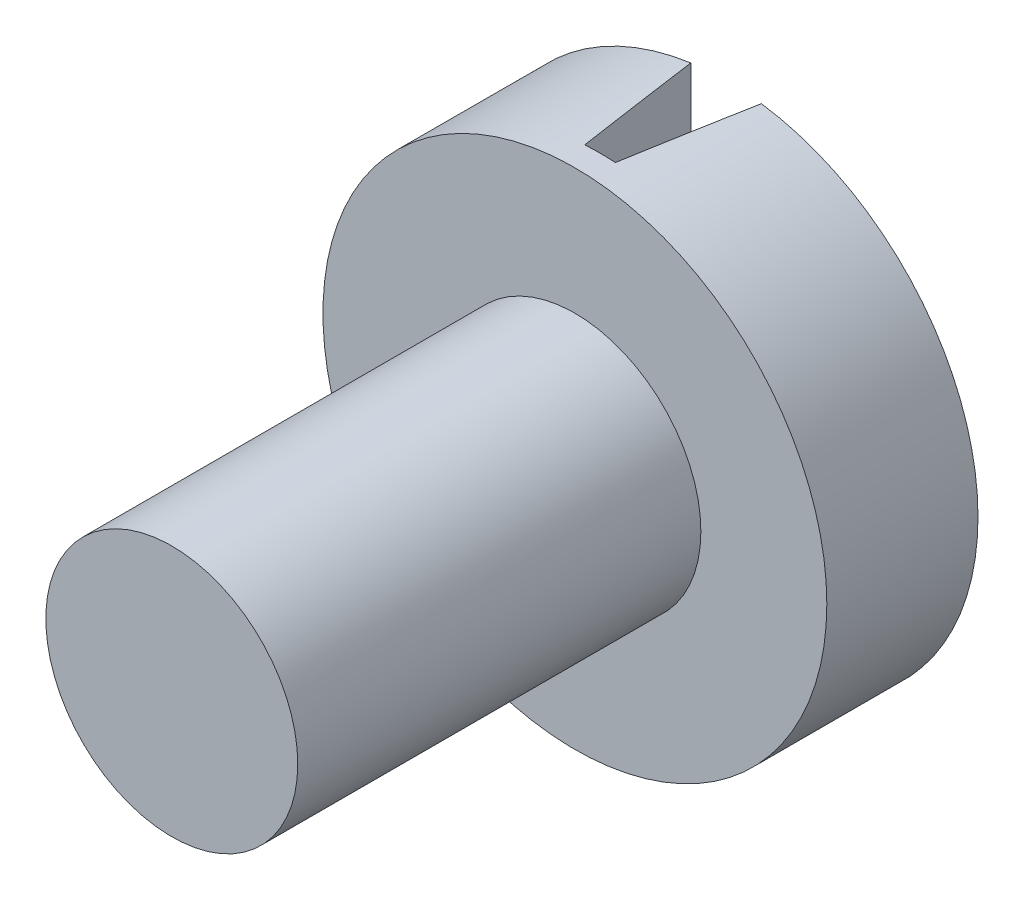
ISO-10303-21;
HEADER;
FILE_DESCRIPTION(('STEP AP214'),'2;1');
FILE_NAME('part.step','',(''),(''),'','','');
FILE_SCHEMA(('AUTOMOTIVE_DESIGN { 1 0 10303 214 1 1 1 1 }'));
ENDSEC;
DATA;
#1=APPLICATION_CONTEXT('core data for automotive mechanical design processes');
#2=APPLICATION_PROTOCOL_DEFINITION('international standard','automotive_design',2000,#1);
#3=PRODUCT_CONTEXT('',#1,'mechanical');
#4=PRODUCT('Part','Part','',(#3));
#5=PRODUCT_RELATED_PRODUCT_CATEGORY('part','',(#4));
#6=PRODUCT_DEFINITION_FORMATION('','',#4);
#7=PRODUCT_DEFINITION_CONTEXT('part definition',#1,'design');
#8=PRODUCT_DEFINITION('design','',#6,#7);
#9=PRODUCT_DEFINITION_SHAPE('','',#8);
#10=(LENGTH_UNIT() NAMED_UNIT(*) SI_UNIT(.MILLI.,.METRE.));
#11=(NAMED_UNIT(*) PLANE_ANGLE_UNIT() SI_UNIT($,.RADIAN.));
#12=(NAMED_UNIT(*) SI_UNIT($,.STERADIAN.) SOLID_ANGLE_UNIT());
#13=UNCERTAINTY_MEASURE_WITH_UNIT(LENGTH_MEASURE(1.E-05),#10,'distance_accuracy_value','');
#14=(GEOMETRIC_REPRESENTATION_CONTEXT(3) GLOBAL_UNCERTAINTY_ASSIGNED_CONTEXT((#13)) GLOBAL_UNIT_ASSIGNED_CONTEXT((#10,
#11,#12)) REPRESENTATION_CONTEXT('',''));
#15=CARTESIAN_POINT('',(0.,0.,0.));
#16=DIRECTION('',(0.,0.,1.));
#17=DIRECTION('',(1.,0.,0.));
#18=AXIS2_PLACEMENT_3D('',#15,#16,#17);
#19=CARTESIAN_POINT('',(0.,0.,-3.));
#20=DIRECTION('',(0.,0.,1.));
#21=DIRECTION('',(1.,0.,0.));
#22=AXIS2_PLACEMENT_3D('',#19,#20,#21);
#23=PLANE('',#22);
#24=CARTESIAN_POINT('',(0.,0.,-3.));
#25=DIRECTION('',(0.,0.,1.));
#26=DIRECTION('',(1.,0.,0.));
#27=AXIS2_PLACEMENT_3D('',#24,#25,#26);
#28=CIRCLE('',#27,5.);
#29=CARTESIAN_POINT('',(-0.7,4.95075751779463,-3.));
#30=VERTEX_POINT('',#29);
#31=CARTESIAN_POINT('',(-0.7,-4.95075751779463,-3.));
#32=VERTEX_POINT('',#31);
#33=EDGE_CURVE('E102',#30,#32,#28,.T.);
#34=ORIENTED_EDGE('',*,*,#33,.F.);
#35=DIRECTION('',(0.,-1.,0.));
#36=VECTOR('',#35,1.);
#37=CARTESIAN_POINT('',(-0.7,0.,-3.));
#38=LINE('',#37,#36);
#39=EDGE_CURVE('E88',#30,#32,#38,.T.);
#40=ORIENTED_EDGE('',*,*,#39,.T.);
#41=EDGE_LOOP('',(#34,#40));
#42=FACE_BOUND('',#41,.T.);
#43=ADVANCED_FACE('F39',(#42),#23,.F.);
#44=CARTESIAN_POINT('',(0.,0.,8.));
#45=DIRECTION('',(0.,0.,-1.));
#46=DIRECTION('',(-1.,0.,0.));
#47=AXIS2_PLACEMENT_3D('',#44,#45,#46);
#48=CYLINDRICAL_SURFACE('',#47,2.5);
#49=CARTESIAN_POINT('',(0.,0.,8.));
#50=DIRECTION('',(0.,0.,1.));
#51=DIRECTION('',(1.,0.,0.));
#52=AXIS2_PLACEMENT_3D('',#49,#50,#51);
#53=CIRCLE('',#52,2.5);
#54=CARTESIAN_POINT('',(2.5,0.,8.));
#55=VERTEX_POINT('',#54);
#56=EDGE_CURVE('E89',#55,#55,#53,.T.);
#57=ORIENTED_EDGE('',*,*,#56,.F.);
#58=EDGE_LOOP('',(#57));
#59=FACE_BOUND('',#58,.T.);
#60=CARTESIAN_POINT('',(0.,0.,0.));
#61=DIRECTION('',(0.,0.,1.));
#62=DIRECTION('',(1.,0.,0.));
#63=AXIS2_PLACEMENT_3D('',#60,#61,#62);
#64=CIRCLE('',#63,2.5);
#65=CARTESIAN_POINT('',(2.5,0.,0.));
#66=VERTEX_POINT('',#65);
#67=EDGE_CURVE('E108',#66,#66,#64,.T.);
#68=ORIENTED_EDGE('',*,*,#67,.T.);
#69=EDGE_LOOP('',(#68));
#70=FACE_BOUND('',#69,.T.);
#71=ADVANCED_FACE('F41',(#59,#70),#48,.T.);
#72=CARTESIAN_POINT('',(0.,0.,8.));
#73=DIRECTION('',(0.,0.,1.));
#74=DIRECTION('',(1.,0.,0.));
#75=AXIS2_PLACEMENT_3D('',#72,#73,#74);
#76=PLANE('',#75);
#77=ORIENTED_EDGE('',*,*,#56,.T.);
#78=EDGE_LOOP('',(#77));
#79=FACE_BOUND('',#78,.T.);
#80=ADVANCED_FACE('F141',(#79),#76,.T.);
#81=CARTESIAN_POINT('',(0.,0.,-3.));
#82=DIRECTION('',(0.,0.,1.));
#83=DIRECTION('',(1.,0.,0.));
#84=AXIS2_PLACEMENT_3D('',#81,#82,#83);
#85=CYLINDRICAL_SURFACE('',#84,5.);
#86=CARTESIAN_POINT('',(0.,0.,1.41962606027253));
#87=DIRECTION('',(-0.987688340595138,0.,0.156434465040231));
#88=DIRECTION('',(0.156434465040231,0.,0.987688340595138));
#89=AXIS2_PLACEMENT_3D('',#86,#87,#88);
#90=ELLIPSE('',#89,31.9622661074983,5.);
#91=CARTESIAN_POINT('',(-0.304038899188659,-4.99074747385401,-0.5));
#92=VERTEX_POINT('',#91);
#93=EDGE_CURVE('E110',#92,#32,#90,.F.);
#94=ORIENTED_EDGE('',*,*,#93,.F.);
#95=CARTESIAN_POINT('',(0.,0.,-0.5));
#96=DIRECTION('',(0.,0.,1.));
#97=DIRECTION('',(1.,0.,0.));
#98=AXIS2_PLACEMENT_3D('',#95,#96,#97);
#99=CIRCLE('',#98,5.);
#100=CARTESIAN_POINT('',(0.304038899188659,-4.99074747385401,-0.5));
#101=VERTEX_POINT('',#100);
#102=EDGE_CURVE('E11',#101,#92,#99,.F.);
#103=ORIENTED_EDGE('',*,*,#102,.F.);
#104=CARTESIAN_POINT('',(0.,0.,1.41962606027253));
#105=DIRECTION('',(0.987688340595138,0.,0.156434465040231));
#106=DIRECTION('',(-0.156434465040231,0.,0.987688340595138));
#107=AXIS2_PLACEMENT_3D('',#104,#105,#106);
#108=ELLIPSE('',#107,31.9622661074983,5.);
#109=CARTESIAN_POINT('',(0.7,-4.95075751779463,-3.));
#110=VERTEX_POINT('',#109);
#111=EDGE_CURVE('E82',#110,#101,#108,.F.);
#112=ORIENTED_EDGE('',*,*,#111,.F.);
#113=CARTESIAN_POINT('',(0.7,4.95075751779463,-3.));
#114=VERTEX_POINT('',#113);
#115=EDGE_CURVE('E96',#110,#114,#28,.T.);
#116=ORIENTED_EDGE('',*,*,#115,.T.);
#117=CARTESIAN_POINT('',(0.304038899188659,4.99074747385401,-0.5));
#118=VERTEX_POINT('',#117);
#119=EDGE_CURVE('E55',#118,#114,#108,.F.);
#120=ORIENTED_EDGE('',*,*,#119,.F.);
#121=CARTESIAN_POINT('',(-0.304038899188659,4.99074747385401,-0.5));
#122=VERTEX_POINT('',#121);
#123=EDGE_CURVE('E43',#122,#118,#99,.F.);
#124=ORIENTED_EDGE('',*,*,#123,.F.);
#125=EDGE_CURVE('E63',#30,#122,#90,.F.);
#126=ORIENTED_EDGE('',*,*,#125,.F.);
#127=ORIENTED_EDGE('',*,*,#33,.T.);
#128=EDGE_LOOP('',(#94,#103,#112,#116,#120,#124,#126,#127));
#129=FACE_BOUND('',#128,.T.);
#130=CARTESIAN_POINT('',(0.,0.,0.));
#131=DIRECTION('',(0.,0.,1.));
#132=DIRECTION('',(1.,0.,0.));
#133=AXIS2_PLACEMENT_3D('',#130,#131,#132);
#134=CIRCLE('',#133,5.);
#135=CARTESIAN_POINT('',(5.,0.,0.));
#136=VERTEX_POINT('',#135);
#137=EDGE_CURVE('E103',#136,#136,#134,.T.);
#138=ORIENTED_EDGE('',*,*,#137,.F.);
#139=EDGE_LOOP('',(#138));
#140=FACE_BOUND('',#139,.T.);
#141=ADVANCED_FACE('F94',(#129,#140),#85,.T.);
#142=ORIENTED_EDGE('',*,*,#115,.F.);
#143=DIRECTION('',(0.,1.,0.));
#144=VECTOR('',#143,1.);
#145=CARTESIAN_POINT('',(0.7,0.,-3.));
#146=LINE('',#145,#144);
#147=EDGE_CURVE('E79',#110,#114,#146,.T.);
#148=ORIENTED_EDGE('',*,*,#147,.T.);
#149=EDGE_LOOP('',(#142,#148));
#150=FACE_BOUND('',#149,.T.);
#151=ADVANCED_FACE('F100',(#150),#23,.F.);
#152=CARTESIAN_POINT('',(0.,0.,0.));
#153=DIRECTION('',(0.,0.,1.));
#154=DIRECTION('',(1.,0.,0.));
#155=AXIS2_PLACEMENT_3D('',#152,#153,#154);
#156=PLANE('',#155);
#157=ORIENTED_EDGE('',*,*,#67,.F.);
#158=EDGE_LOOP('',(#157));
#159=FACE_BOUND('',#158,.T.);
#160=ORIENTED_EDGE('',*,*,#137,.T.);
#161=EDGE_LOOP('',(#160));
#162=FACE_BOUND('',#161,.T.);
#163=ADVANCED_FACE('F146',(#159,#162),#156,.T.);
#164=CARTESIAN_POINT('',(-0.7,-5.5,-3.));
#165=DIRECTION('',(-0.987688340595138,0.,0.156434465040231));
#166=DIRECTION('',(0.156434465040231,0.,0.987688340595138));
#167=AXIS2_PLACEMENT_3D('',#164,#165,#166);
#168=PLANE('',#167);
#169=ORIENTED_EDGE('',*,*,#93,.T.);
#170=ORIENTED_EDGE('',*,*,#39,.F.);
#171=ORIENTED_EDGE('',*,*,#125,.T.);
#172=DIRECTION('',(0.,1.,0.));
#173=VECTOR('',#172,1.);
#174=CARTESIAN_POINT('',(-0.304038899188659,-5.5,-0.5));
#175=LINE('',#174,#173);
#176=EDGE_CURVE('E127',#92,#122,#175,.T.);
#177=ORIENTED_EDGE('',*,*,#176,.F.);
#178=EDGE_LOOP('',(#169,#170,#171,#177));
#179=FACE_BOUND('',#178,.T.);
#180=ADVANCED_FACE('F135',(#179),#168,.F.);
#181=CARTESIAN_POINT('',(0.7,-5.5,-3.));
#182=DIRECTION('',(0.987688340595138,0.,0.156434465040231));
#183=DIRECTION('',(0.156434465040231,0.,-0.987688340595138));
#184=AXIS2_PLACEMENT_3D('',#181,#182,#183);
#185=PLANE('',#184);
#186=ORIENTED_EDGE('',*,*,#119,.T.);
#187=ORIENTED_EDGE('',*,*,#147,.F.);
#188=ORIENTED_EDGE('',*,*,#111,.T.);
#189=DIRECTION('',(0.,-1.,0.));
#190=VECTOR('',#189,1.);
#191=CARTESIAN_POINT('',(0.304038899188659,-5.5,-0.5));
#192=LINE('',#191,#190);
#193=EDGE_CURVE('E98',#118,#101,#192,.T.);
#194=ORIENTED_EDGE('',*,*,#193,.F.);
#195=EDGE_LOOP('',(#186,#187,#188,#194));
#196=FACE_BOUND('',#195,.T.);
#197=ADVANCED_FACE('F81',(#196),#185,.F.);
#198=CARTESIAN_POINT('',(0.,0.,-0.5));
#199=DIRECTION('',(0.,0.,1.));
#200=DIRECTION('',(1.,0.,0.));
#201=AXIS2_PLACEMENT_3D('',#198,#199,#200);
#202=PLANE('',#201);
#203=ORIENTED_EDGE('',*,*,#102,.T.);
#204=ORIENTED_EDGE('',*,*,#176,.T.);
#205=ORIENTED_EDGE('',*,*,#123,.T.);
#206=ORIENTED_EDGE('',*,*,#193,.T.);
#207=EDGE_LOOP('',(#203,#204,#205,#206));
#208=FACE_BOUND('',#207,.T.);
#209=ADVANCED_FACE('F126',(#208),#202,.F.);
#210=CLOSED_SHELL('',(#43,#71,#80,#141,#151,#163,#180,#197,#209));
#211=MANIFOLD_SOLID_BREP('B2',#210);
#212=ADVANCED_BREP_SHAPE_REPRESENTATION('',(#18,#211),#14);
#213=SHAPE_DEFINITION_REPRESENTATION(#9,#212);
ENDSEC;
END-ISO-10303-21;
